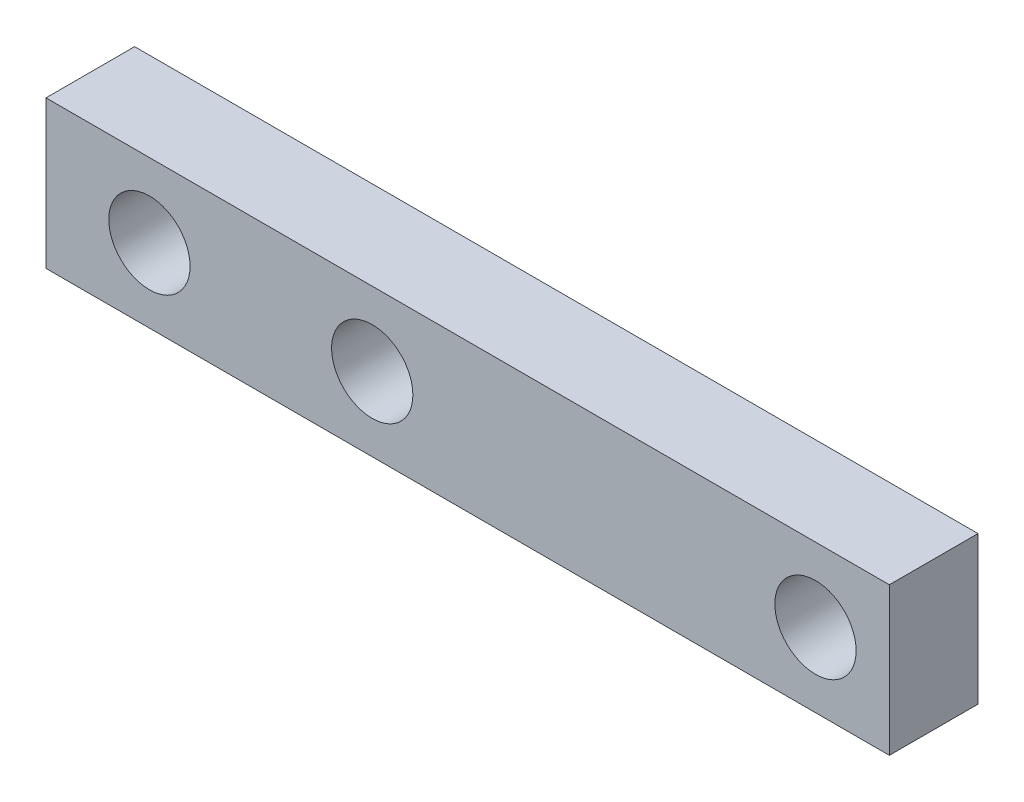
ISO-10303-21;
HEADER;
FILE_DESCRIPTION(('STEP AP214'),'2;1');
FILE_NAME('part.step','',(''),(''),'','','');
FILE_SCHEMA(('AUTOMOTIVE_DESIGN { 1 0 10303 214 1 1 1 1 }'));
ENDSEC;
DATA;
#1=APPLICATION_CONTEXT('core data for automotive mechanical design processes');
#2=APPLICATION_PROTOCOL_DEFINITION('international standard','automotive_design',2000,#1);
#3=PRODUCT_CONTEXT('',#1,'mechanical');
#4=PRODUCT('Part','Part','',(#3));
#5=PRODUCT_RELATED_PRODUCT_CATEGORY('part','',(#4));
#6=PRODUCT_DEFINITION_FORMATION('','',#4);
#7=PRODUCT_DEFINITION_CONTEXT('part definition',#1,'design');
#8=PRODUCT_DEFINITION('design','',#6,#7);
#9=PRODUCT_DEFINITION_SHAPE('','',#8);
#10=(LENGTH_UNIT() NAMED_UNIT(*) SI_UNIT(.MILLI.,.METRE.));
#11=(NAMED_UNIT(*) PLANE_ANGLE_UNIT() SI_UNIT($,.RADIAN.));
#12=(NAMED_UNIT(*) SI_UNIT($,.STERADIAN.) SOLID_ANGLE_UNIT());
#13=UNCERTAINTY_MEASURE_WITH_UNIT(LENGTH_MEASURE(1.E-05),#10,'distance_accuracy_value','');
#14=(GEOMETRIC_REPRESENTATION_CONTEXT(3) GLOBAL_UNCERTAINTY_ASSIGNED_CONTEXT((#13)) GLOBAL_UNIT_ASSIGNED_CONTEXT((#10,
#11,#12)) REPRESENTATION_CONTEXT('',''));
#15=CARTESIAN_POINT('',(0.,0.,0.));
#16=DIRECTION('',(0.,0.,1.));
#17=DIRECTION('',(1.,0.,0.));
#18=AXIS2_PLACEMENT_3D('',#15,#16,#17);
#19=CARTESIAN_POINT('',(0.,0.,3.));
#20=DIRECTION('',(0.,0.,-1.));
#21=DIRECTION('',(-1.,0.,0.));
#22=AXIS2_PLACEMENT_3D('',#19,#20,#21);
#23=PLANE('',#22);
#24=DIRECTION('',(1.,0.,0.));
#25=VECTOR('',#24,1.);
#26=CARTESIAN_POINT('',(28.54,0.,3.));
#27=LINE('',#26,#25);
#28=CARTESIAN_POINT('',(0.,0.,3.));
#29=VERTEX_POINT('',#28);
#30=CARTESIAN_POINT('',(28.54,0.,3.));
#31=VERTEX_POINT('',#30);
#32=EDGE_CURVE('E98',#29,#31,#27,.T.);
#33=ORIENTED_EDGE('',*,*,#32,.T.);
#34=DIRECTION('',(0.,1.,0.));
#35=VECTOR('',#34,1.);
#36=CARTESIAN_POINT('',(28.54,5.,3.));
#37=LINE('',#36,#35);
#38=CARTESIAN_POINT('',(28.54,5.,3.));
#39=VERTEX_POINT('',#38);
#40=EDGE_CURVE('E93',#31,#39,#37,.T.);
#41=ORIENTED_EDGE('',*,*,#40,.T.);
#42=DIRECTION('',(-1.,0.,0.));
#43=VECTOR('',#42,1.);
#44=CARTESIAN_POINT('',(0.,5.,3.));
#45=LINE('',#44,#43);
#46=CARTESIAN_POINT('',(0.,5.,3.));
#47=VERTEX_POINT('',#46);
#48=EDGE_CURVE('E96',#39,#47,#45,.T.);
#49=ORIENTED_EDGE('',*,*,#48,.T.);
#50=DIRECTION('',(0.,-1.,0.));
#51=VECTOR('',#50,1.);
#52=CARTESIAN_POINT('',(0.,0.,3.));
#53=LINE('',#52,#51);
#54=EDGE_CURVE('E63',#47,#29,#53,.T.);
#55=ORIENTED_EDGE('',*,*,#54,.T.);
#56=EDGE_LOOP('',(#33,#41,#49,#55));
#57=FACE_BOUND('',#56,.T.);
#58=CARTESIAN_POINT('',(3.5,2.5,3.));
#59=DIRECTION('',(0.,0.,1.));
#60=DIRECTION('',(1.,0.,0.));
#61=AXIS2_PLACEMENT_3D('',#58,#59,#60);
#62=CIRCLE('',#61,1.375);
#63=CARTESIAN_POINT('',(4.875,2.5,3.));
#64=VERTEX_POINT('',#63);
#65=EDGE_CURVE('E118',#64,#64,#62,.T.);
#66=ORIENTED_EDGE('',*,*,#65,.F.);
#67=EDGE_LOOP('',(#66));
#68=FACE_BOUND('',#67,.T.);
#69=CARTESIAN_POINT('',(11.04,2.5,3.));
#70=DIRECTION('',(0.,0.,1.));
#71=DIRECTION('',(1.,0.,0.));
#72=AXIS2_PLACEMENT_3D('',#69,#70,#71);
#73=CIRCLE('',#72,1.375);
#74=CARTESIAN_POINT('',(12.415,2.5,3.));
#75=VERTEX_POINT('',#74);
#76=EDGE_CURVE('E140',#75,#75,#73,.T.);
#77=ORIENTED_EDGE('',*,*,#76,.F.);
#78=EDGE_LOOP('',(#77));
#79=FACE_BOUND('',#78,.T.);
#80=CARTESIAN_POINT('',(26.04,2.5,3.));
#81=DIRECTION('',(0.,0.,1.));
#82=DIRECTION('',(1.,0.,0.));
#83=AXIS2_PLACEMENT_3D('',#80,#81,#82);
#84=CIRCLE('',#83,1.37500000000001);
#85=CARTESIAN_POINT('',(27.415,2.5,3.));
#86=VERTEX_POINT('',#85);
#87=EDGE_CURVE('E148',#86,#86,#84,.T.);
#88=ORIENTED_EDGE('',*,*,#87,.F.);
#89=EDGE_LOOP('',(#88));
#90=FACE_BOUND('',#89,.T.);
#91=ADVANCED_FACE('F45',(#57,#68,#79,#90),#23,.F.);
#92=CARTESIAN_POINT('',(0.,0.,0.));
#93=DIRECTION('',(0.,0.,-1.));
#94=DIRECTION('',(-1.,0.,0.));
#95=AXIS2_PLACEMENT_3D('',#92,#93,#94);
#96=PLANE('',#95);
#97=CARTESIAN_POINT('',(11.04,2.5,0.));
#98=DIRECTION('',(0.,0.,1.));
#99=DIRECTION('',(1.,0.,0.));
#100=AXIS2_PLACEMENT_3D('',#97,#98,#99);
#101=CIRCLE('',#100,1.375);
#102=CARTESIAN_POINT('',(12.415,2.5,0.));
#103=VERTEX_POINT('',#102);
#104=EDGE_CURVE('E144',#103,#103,#101,.T.);
#105=ORIENTED_EDGE('',*,*,#104,.T.);
#106=EDGE_LOOP('',(#105));
#107=FACE_BOUND('',#106,.T.);
#108=DIRECTION('',(1.,0.,0.));
#109=VECTOR('',#108,1.);
#110=CARTESIAN_POINT('',(28.54,0.,0.));
#111=LINE('',#110,#109);
#112=CARTESIAN_POINT('',(0.,0.,0.));
#113=VERTEX_POINT('',#112);
#114=CARTESIAN_POINT('',(28.54,0.,0.));
#115=VERTEX_POINT('',#114);
#116=EDGE_CURVE('E114',#113,#115,#111,.T.);
#117=ORIENTED_EDGE('',*,*,#116,.F.);
#118=DIRECTION('',(0.,-1.,0.));
#119=VECTOR('',#118,1.);
#120=CARTESIAN_POINT('',(0.,0.,0.));
#121=LINE('',#120,#119);
#122=CARTESIAN_POINT('',(0.,5.,0.));
#123=VERTEX_POINT('',#122);
#124=EDGE_CURVE('E86',#123,#113,#121,.T.);
#125=ORIENTED_EDGE('',*,*,#124,.F.);
#126=DIRECTION('',(-1.,0.,0.));
#127=VECTOR('',#126,1.);
#128=CARTESIAN_POINT('',(0.,5.,0.));
#129=LINE('',#128,#127);
#130=CARTESIAN_POINT('',(28.54,5.,0.));
#131=VERTEX_POINT('',#130);
#132=EDGE_CURVE('E80',#131,#123,#129,.T.);
#133=ORIENTED_EDGE('',*,*,#132,.F.);
#134=DIRECTION('',(0.,1.,0.));
#135=VECTOR('',#134,1.);
#136=CARTESIAN_POINT('',(28.54,5.,0.));
#137=LINE('',#136,#135);
#138=EDGE_CURVE('E103',#115,#131,#137,.T.);
#139=ORIENTED_EDGE('',*,*,#138,.F.);
#140=EDGE_LOOP('',(#117,#125,#133,#139));
#141=FACE_BOUND('',#140,.T.);
#142=CARTESIAN_POINT('',(3.5,2.5,0.));
#143=DIRECTION('',(0.,0.,1.));
#144=DIRECTION('',(1.,0.,0.));
#145=AXIS2_PLACEMENT_3D('',#142,#143,#144);
#146=CIRCLE('',#145,1.375);
#147=CARTESIAN_POINT('',(4.875,2.5,0.));
#148=VERTEX_POINT('',#147);
#149=EDGE_CURVE('E136',#148,#148,#146,.T.);
#150=ORIENTED_EDGE('',*,*,#149,.T.);
#151=EDGE_LOOP('',(#150));
#152=FACE_BOUND('',#151,.T.);
#153=CARTESIAN_POINT('',(26.04,2.5,0.));
#154=DIRECTION('',(0.,0.,1.));
#155=DIRECTION('',(1.,0.,0.));
#156=AXIS2_PLACEMENT_3D('',#153,#154,#155);
#157=CIRCLE('',#156,1.37500000000001);
#158=CARTESIAN_POINT('',(27.415,2.5,0.));
#159=VERTEX_POINT('',#158);
#160=EDGE_CURVE('E152',#159,#159,#157,.T.);
#161=ORIENTED_EDGE('',*,*,#160,.T.);
#162=EDGE_LOOP('',(#161));
#163=FACE_BOUND('',#162,.T.);
#164=ADVANCED_FACE('F131',(#107,#141,#152,#163),#96,.T.);
#165=CARTESIAN_POINT('',(28.54,0.,3.));
#166=DIRECTION('',(0.,1.,0.));
#167=DIRECTION('',(-1.,0.,0.));
#168=AXIS2_PLACEMENT_3D('',#165,#166,#167);
#169=PLANE('',#168);
#170=ORIENTED_EDGE('',*,*,#116,.T.);
#171=DIRECTION('',(0.,0.,-1.));
#172=VECTOR('',#171,1.);
#173=CARTESIAN_POINT('',(28.54,0.,3.));
#174=LINE('',#173,#172);
#175=EDGE_CURVE('E11',#31,#115,#174,.T.);
#176=ORIENTED_EDGE('',*,*,#175,.F.);
#177=ORIENTED_EDGE('',*,*,#32,.F.);
#178=DIRECTION('',(0.,0.,-1.));
#179=VECTOR('',#178,1.);
#180=CARTESIAN_POINT('',(0.,0.,3.));
#181=LINE('',#180,#179);
#182=EDGE_CURVE('E110',#29,#113,#181,.T.);
#183=ORIENTED_EDGE('',*,*,#182,.T.);
#184=EDGE_LOOP('',(#170,#176,#177,#183));
#185=FACE_BOUND('',#184,.T.);
#186=ADVANCED_FACE('F47',(#185),#169,.F.);
#187=CARTESIAN_POINT('',(28.54,5.,3.));
#188=DIRECTION('',(-1.,0.,0.));
#189=DIRECTION('',(0.,0.,1.));
#190=AXIS2_PLACEMENT_3D('',#187,#188,#189);
#191=PLANE('',#190);
#192=ORIENTED_EDGE('',*,*,#138,.T.);
#193=DIRECTION('',(0.,0.,-1.));
#194=VECTOR('',#193,1.);
#195=CARTESIAN_POINT('',(28.54,5.,3.));
#196=LINE('',#195,#194);
#197=EDGE_CURVE('E55',#39,#131,#196,.T.);
#198=ORIENTED_EDGE('',*,*,#197,.F.);
#199=ORIENTED_EDGE('',*,*,#40,.F.);
#200=ORIENTED_EDGE('',*,*,#175,.T.);
#201=EDGE_LOOP('',(#192,#198,#199,#200));
#202=FACE_BOUND('',#201,.T.);
#203=ADVANCED_FACE('F102',(#202),#191,.F.);
#204=CARTESIAN_POINT('',(0.,5.,3.));
#205=DIRECTION('',(0.,-1.,0.));
#206=DIRECTION('',(1.,0.,0.));
#207=AXIS2_PLACEMENT_3D('',#204,#205,#206);
#208=PLANE('',#207);
#209=ORIENTED_EDGE('',*,*,#132,.T.);
#210=DIRECTION('',(0.,0.,-1.));
#211=VECTOR('',#210,1.);
#212=CARTESIAN_POINT('',(0.,5.,3.));
#213=LINE('',#212,#211);
#214=EDGE_CURVE('E105',#47,#123,#213,.T.);
#215=ORIENTED_EDGE('',*,*,#214,.F.);
#216=ORIENTED_EDGE('',*,*,#48,.F.);
#217=ORIENTED_EDGE('',*,*,#197,.T.);
#218=EDGE_LOOP('',(#209,#215,#216,#217));
#219=FACE_BOUND('',#218,.T.);
#220=ADVANCED_FACE('F106',(#219),#208,.F.);
#221=CARTESIAN_POINT('',(0.,0.,3.));
#222=DIRECTION('',(1.,0.,0.));
#223=DIRECTION('',(0.,0.,-1.));
#224=AXIS2_PLACEMENT_3D('',#221,#222,#223);
#225=PLANE('',#224);
#226=ORIENTED_EDGE('',*,*,#124,.T.);
#227=ORIENTED_EDGE('',*,*,#182,.F.);
#228=ORIENTED_EDGE('',*,*,#54,.F.);
#229=ORIENTED_EDGE('',*,*,#214,.T.);
#230=EDGE_LOOP('',(#226,#227,#228,#229));
#231=FACE_BOUND('',#230,.T.);
#232=ADVANCED_FACE('F128',(#231),#225,.F.);
#233=CARTESIAN_POINT('',(3.5,2.5,3.));
#234=DIRECTION('',(0.,0.,-1.));
#235=DIRECTION('',(-1.,0.,0.));
#236=AXIS2_PLACEMENT_3D('',#233,#234,#235);
#237=CYLINDRICAL_SURFACE('',#236,1.375);
#238=ORIENTED_EDGE('',*,*,#65,.T.);
#239=EDGE_LOOP('',(#238));
#240=FACE_BOUND('',#239,.T.);
#241=ORIENTED_EDGE('',*,*,#149,.F.);
#242=EDGE_LOOP('',(#241));
#243=FACE_BOUND('',#242,.T.);
#244=ADVANCED_FACE('F171',(#240,#243),#237,.F.);
#245=CARTESIAN_POINT('',(11.04,2.5,3.));
#246=DIRECTION('',(0.,0.,-1.));
#247=DIRECTION('',(-1.,0.,0.));
#248=AXIS2_PLACEMENT_3D('',#245,#246,#247);
#249=CYLINDRICAL_SURFACE('',#248,1.375);
#250=ORIENTED_EDGE('',*,*,#76,.T.);
#251=EDGE_LOOP('',(#250));
#252=FACE_BOUND('',#251,.T.);
#253=ORIENTED_EDGE('',*,*,#104,.F.);
#254=EDGE_LOOP('',(#253));
#255=FACE_BOUND('',#254,.T.);
#256=ADVANCED_FACE('F216',(#252,#255),#249,.F.);
#257=CARTESIAN_POINT('',(26.04,2.5,3.));
#258=DIRECTION('',(0.,0.,-1.));
#259=DIRECTION('',(-1.,0.,0.));
#260=AXIS2_PLACEMENT_3D('',#257,#258,#259);
#261=CYLINDRICAL_SURFACE('',#260,1.37500000000001);
#262=ORIENTED_EDGE('',*,*,#87,.T.);
#263=EDGE_LOOP('',(#262));
#264=FACE_BOUND('',#263,.T.);
#265=ORIENTED_EDGE('',*,*,#160,.F.);
#266=EDGE_LOOP('',(#265));
#267=FACE_BOUND('',#266,.T.);
#268=ADVANCED_FACE('F160',(#264,#267),#261,.F.);
#269=CLOSED_SHELL('',(#91,#164,#186,#203,#220,#232,#244,#256,#268));
#270=MANIFOLD_SOLID_BREP('B2',#269);
#271=ADVANCED_BREP_SHAPE_REPRESENTATION('',(#18,#270),#14);
#272=SHAPE_DEFINITION_REPRESENTATION(#9,#271);
ENDSEC;
END-ISO-10303-21;
